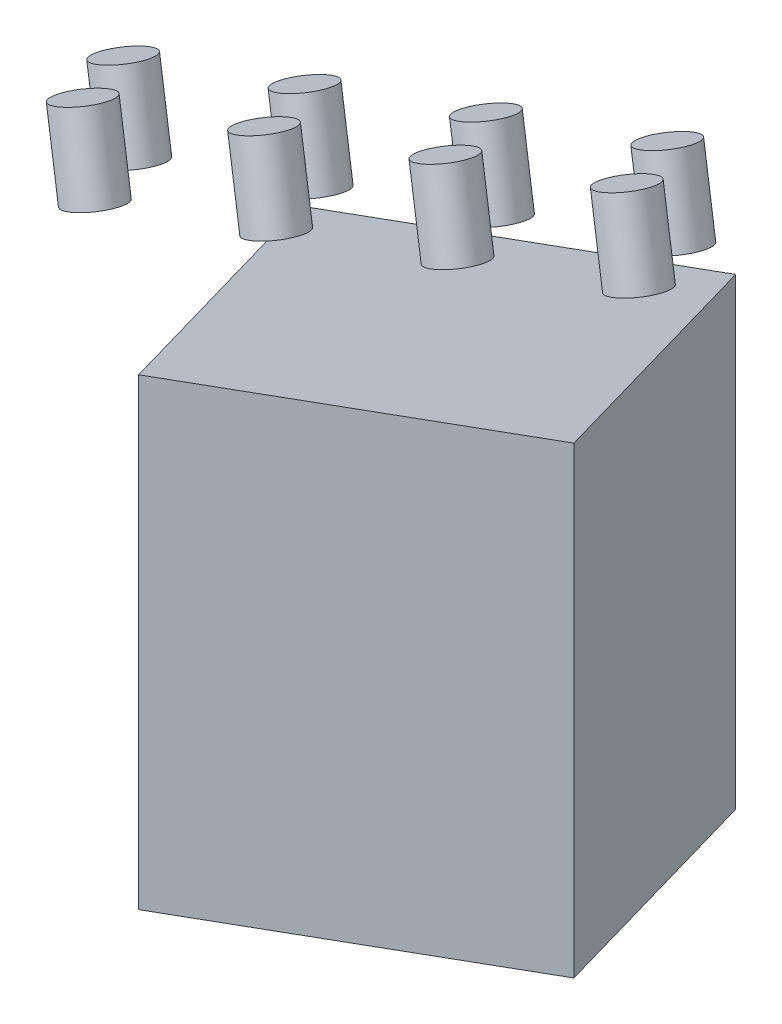
ISO-10303-21;
HEADER;
FILE_DESCRIPTION(('STEP AP214'),'2;1');
FILE_NAME('part.step','',(''),(''),'','','');
FILE_SCHEMA(('AUTOMOTIVE_DESIGN { 1 0 10303 214 1 1 1 1 }'));
ENDSEC;
DATA;
#1=APPLICATION_CONTEXT('core data for automotive mechanical design processes');
#2=APPLICATION_PROTOCOL_DEFINITION('international standard','automotive_design',2000,#1);
#3=PRODUCT_CONTEXT('',#1,'mechanical');
#4=PRODUCT('Part','Part','',(#3));
#5=PRODUCT_RELATED_PRODUCT_CATEGORY('part','',(#4));
#6=PRODUCT_DEFINITION_FORMATION('','',#4);
#7=PRODUCT_DEFINITION_CONTEXT('part definition',#1,'design');
#8=PRODUCT_DEFINITION('design','',#6,#7);
#9=PRODUCT_DEFINITION_SHAPE('','',#8);
#10=(LENGTH_UNIT() NAMED_UNIT(*) SI_UNIT(.MILLI.,.METRE.));
#11=(NAMED_UNIT(*) PLANE_ANGLE_UNIT() SI_UNIT($,.RADIAN.));
#12=(NAMED_UNIT(*) SI_UNIT($,.STERADIAN.) SOLID_ANGLE_UNIT());
#13=UNCERTAINTY_MEASURE_WITH_UNIT(LENGTH_MEASURE(1.E-05),#10,'distance_accuracy_value','');
#14=(GEOMETRIC_REPRESENTATION_CONTEXT(3) GLOBAL_UNCERTAINTY_ASSIGNED_CONTEXT((#13)) GLOBAL_UNIT_ASSIGNED_CONTEXT((#10,
#11,#12)) REPRESENTATION_CONTEXT('',''));
#15=CARTESIAN_POINT('',(0.,0.,0.));
#16=DIRECTION('',(0.,0.,1.));
#17=DIRECTION('',(1.,0.,0.));
#18=AXIS2_PLACEMENT_3D('',#15,#16,#17);
#19=CARTESIAN_POINT('',(-29.5986839364483,58.7634470395438,-6.62993275582684));
#20=DIRECTION('',(0.3365382859498,-0.924631341429047,0.178322361292947));
#21=DIRECTION('',(0.939692620785909,0.342020143325666,0.));
#22=AXIS2_PLACEMENT_3D('',#19,#20,#21);
#23=CYLINDRICAL_SURFACE('',#22,3.35836070254508);
#24=CARTESIAN_POINT('',(-29.5986839364483,58.7634470395438,-6.62993275582684));
#25=DIRECTION('',(-0.3365382859498,0.924631341429047,-0.178322361292947));
#26=DIRECTION('',(-0.939692620785909,-0.342020143325666,0.));
#27=AXIS2_PLACEMENT_3D('',#24,#25,#26);
#28=CIRCLE('',#27,3.35836070254508);
#29=CARTESIAN_POINT('',(-32.7545107065673,57.6148200307201,-6.62993275582684));
#30=VERTEX_POINT('',#29);
#31=EDGE_CURVE('E11',#30,#30,#28,.T.);
#32=ORIENTED_EDGE('',*,*,#31,.F.);
#33=EDGE_LOOP('',(#32));
#34=FACE_BOUND('',#33,.T.);
#35=CARTESIAN_POINT('',(-26.2333010769503,49.5171336252533,-4.84670914289737));
#36=DIRECTION('',(-0.3365382859498,0.924631341429047,-0.178322361292947));
#37=DIRECTION('',(-0.939692620785909,-0.342020143325666,0.));
#38=AXIS2_PLACEMENT_3D('',#35,#36,#37);
#39=CIRCLE('',#38,3.35836070254508);
#40=CARTESIAN_POINT('',(-29.3891278470693,48.3685066164296,-4.84670914289737));
#41=VERTEX_POINT('',#40);
#42=EDGE_CURVE('E45',#41,#41,#39,.T.);
#43=ORIENTED_EDGE('',*,*,#42,.T.);
#44=EDGE_LOOP('',(#43));
#45=FACE_BOUND('',#44,.T.);
#46=ADVANCED_FACE('F42',(#34,#45),#23,.T.);
#47=CARTESIAN_POINT('',(-29.5986839364483,58.7634470395438,-6.62993275582684));
#48=DIRECTION('',(-0.3365382859498,0.924631341429047,-0.178322361292947));
#49=DIRECTION('',(-0.939692620785909,-0.342020143325666,0.));
#50=AXIS2_PLACEMENT_3D('',#47,#48,#49);
#51=PLANE('',#50);
#52=ORIENTED_EDGE('',*,*,#31,.T.);
#53=EDGE_LOOP('',(#52));
#54=FACE_BOUND('',#53,.T.);
#55=ADVANCED_FACE('F57',(#54),#51,.T.);
#56=CARTESIAN_POINT('',(-26.2333010769503,49.5171336252533,-4.84670914289737));
#57=DIRECTION('',(-0.3365382859498,0.924631341429047,-0.178322361292947));
#58=DIRECTION('',(-0.939692620785909,-0.342020143325666,0.));
#59=AXIS2_PLACEMENT_3D('',#56,#57,#58);
#60=PLANE('',#59);
#61=ORIENTED_EDGE('',*,*,#42,.F.);
#62=EDGE_LOOP('',(#61));
#63=FACE_BOUND('',#62,.T.);
#64=ADVANCED_FACE('F55',(#63),#60,.F.);
#65=CLOSED_SHELL('',(#46,#55,#64));
#66=MANIFOLD_SOLID_BREP('B2',#65);
#67=CARTESIAN_POINT('',(-22.550989280554,63.6982959646013,5.65734790850802));
#68=DIRECTION('',(0.3365382859498,-0.924631341429047,0.178322361292947));
#69=DIRECTION('',(0.939692620785909,0.342020143325666,0.));
#70=AXIS2_PLACEMENT_3D('',#67,#68,#69);
#71=CYLINDRICAL_SURFACE('',#70,3.35836070254508);
#72=CARTESIAN_POINT('',(-22.550989280554,63.6982959646013,5.65734790850802));
#73=DIRECTION('',(-0.3365382859498,0.924631341429047,-0.178322361292947));
#74=DIRECTION('',(-0.939692620785909,-0.342020143325666,0.));
#75=AXIS2_PLACEMENT_3D('',#72,#73,#74);
#76=CIRCLE('',#75,3.35836070254508);
#77=CARTESIAN_POINT('',(-25.706816050673,62.5496689557776,5.65734790850802));
#78=VERTEX_POINT('',#77);
#79=EDGE_CURVE('E41',#78,#78,#76,.T.);
#80=ORIENTED_EDGE('',*,*,#79,.F.);
#81=EDGE_LOOP('',(#80));
#82=FACE_BOUND('',#81,.T.);
#83=CARTESIAN_POINT('',(-19.185606421056,54.4519825503108,7.4405715214375));
#84=DIRECTION('',(-0.3365382859498,0.924631341429047,-0.178322361292947));
#85=DIRECTION('',(-0.939692620785909,-0.342020143325666,0.));
#86=AXIS2_PLACEMENT_3D('',#83,#84,#85);
#87=CIRCLE('',#86,3.35836070254508);
#88=CARTESIAN_POINT('',(-22.3414331911749,53.3033555414871,7.4405715214375));
#89=VERTEX_POINT('',#88);
#90=EDGE_CURVE('E94',#89,#89,#87,.T.);
#91=ORIENTED_EDGE('',*,*,#90,.T.);
#92=EDGE_LOOP('',(#91));
#93=FACE_BOUND('',#92,.T.);
#94=ADVANCED_FACE('F91',(#82,#93),#71,.T.);
#95=CARTESIAN_POINT('',(-22.550989280554,63.6982959646013,5.65734790850802));
#96=DIRECTION('',(-0.3365382859498,0.924631341429047,-0.178322361292947));
#97=DIRECTION('',(-0.939692620785909,-0.342020143325666,0.));
#98=AXIS2_PLACEMENT_3D('',#95,#96,#97);
#99=PLANE('',#98);
#100=ORIENTED_EDGE('',*,*,#79,.T.);
#101=EDGE_LOOP('',(#100));
#102=FACE_BOUND('',#101,.T.);
#103=ADVANCED_FACE('F106',(#102),#99,.T.);
#104=CARTESIAN_POINT('',(-19.185606421056,54.4519825503108,7.4405715214375));
#105=DIRECTION('',(-0.3365382859498,0.924631341429047,-0.178322361292947));
#106=DIRECTION('',(-0.939692620785909,-0.342020143325666,0.));
#107=AXIS2_PLACEMENT_3D('',#104,#105,#106);
#108=PLANE('',#107);
#109=ORIENTED_EDGE('',*,*,#90,.F.);
#110=EDGE_LOOP('',(#109));
#111=FACE_BOUND('',#110,.T.);
#112=ADVANCED_FACE('F104',(#111),#108,.F.);
#113=CLOSED_SHELL('',(#94,#103,#112));
#114=MANIFOLD_SOLID_BREP('B6',#113);
#115=CARTESIAN_POINT('',(-6.10636841680053,67.3139506226855,-6.62993275582684));
#116=DIRECTION('',(0.3365382859498,-0.924631341429047,0.178322361292947));
#117=DIRECTION('',(0.939692620785909,0.342020143325666,0.));
#118=AXIS2_PLACEMENT_3D('',#115,#116,#117);
#119=CYLINDRICAL_SURFACE('',#118,3.35836070254508);
#120=CARTESIAN_POINT('',(-6.10636841680053,67.3139506226855,-6.62993275582684));
#121=DIRECTION('',(-0.3365382859498,0.924631341429047,-0.178322361292947));
#122=DIRECTION('',(-0.939692620785909,-0.342020143325666,0.));
#123=AXIS2_PLACEMENT_3D('',#120,#121,#122);
#124=CIRCLE('',#123,3.35836070254508);
#125=CARTESIAN_POINT('',(-9.26219518691953,66.1653236138617,-6.62993275582684));
#126=VERTEX_POINT('',#125);
#127=EDGE_CURVE('E90',#126,#126,#124,.T.);
#128=ORIENTED_EDGE('',*,*,#127,.F.);
#129=EDGE_LOOP('',(#128));
#130=FACE_BOUND('',#129,.T.);
#131=CARTESIAN_POINT('',(-2.74098555730253,58.067637208395,-4.84670914289737));
#132=DIRECTION('',(-0.3365382859498,0.924631341429047,-0.178322361292947));
#133=DIRECTION('',(-0.939692620785909,-0.342020143325666,0.));
#134=AXIS2_PLACEMENT_3D('',#131,#132,#133);
#135=CIRCLE('',#134,3.35836070254508);
#136=CARTESIAN_POINT('',(-5.89681232742153,56.9190101995712,-4.84670914289737));
#137=VERTEX_POINT('',#136);
#138=EDGE_CURVE('E143',#137,#137,#135,.T.);
#139=ORIENTED_EDGE('',*,*,#138,.T.);
#140=EDGE_LOOP('',(#139));
#141=FACE_BOUND('',#140,.T.);
#142=ADVANCED_FACE('F140',(#130,#141),#119,.T.);
#143=CARTESIAN_POINT('',(-6.10636841680053,67.3139506226855,-6.62993275582684));
#144=DIRECTION('',(-0.3365382859498,0.924631341429047,-0.178322361292947));
#145=DIRECTION('',(-0.939692620785909,-0.342020143325666,0.));
#146=AXIS2_PLACEMENT_3D('',#143,#144,#145);
#147=PLANE('',#146);
#148=ORIENTED_EDGE('',*,*,#127,.T.);
#149=EDGE_LOOP('',(#148));
#150=FACE_BOUND('',#149,.T.);
#151=ADVANCED_FACE('F155',(#150),#147,.T.);
#152=CARTESIAN_POINT('',(-2.74098555730253,58.067637208395,-4.84670914289737));
#153=DIRECTION('',(-0.3365382859498,0.924631341429047,-0.178322361292947));
#154=DIRECTION('',(-0.939692620785909,-0.342020143325666,0.));
#155=AXIS2_PLACEMENT_3D('',#152,#153,#154);
#156=PLANE('',#155);
#157=ORIENTED_EDGE('',*,*,#138,.F.);
#158=EDGE_LOOP('',(#157));
#159=FACE_BOUND('',#158,.T.);
#160=ADVANCED_FACE('F153',(#159),#156,.F.);
#161=CLOSED_SHELL('',(#142,#151,#160));
#162=MANIFOLD_SOLID_BREP('B36',#161);
#163=CARTESIAN_POINT('',(0.941326239093785,72.248799547743,5.65734790850802));
#164=DIRECTION('',(0.3365382859498,-0.924631341429047,0.178322361292947));
#165=DIRECTION('',(0.939692620785909,0.342020143325666,0.));
#166=AXIS2_PLACEMENT_3D('',#163,#164,#165);
#167=CYLINDRICAL_SURFACE('',#166,3.35836070254508);
#168=CARTESIAN_POINT('',(0.941326239093785,72.248799547743,5.65734790850802));
#169=DIRECTION('',(-0.3365382859498,0.924631341429047,-0.178322361292947));
#170=DIRECTION('',(-0.939692620785909,-0.342020143325666,0.));
#171=AXIS2_PLACEMENT_3D('',#168,#169,#170);
#172=CIRCLE('',#171,3.35836070254508);
#173=CARTESIAN_POINT('',(-2.21450053102521,71.1001725389192,5.65734790850802));
#174=VERTEX_POINT('',#173);
#175=EDGE_CURVE('E139',#174,#174,#172,.T.);
#176=ORIENTED_EDGE('',*,*,#175,.F.);
#177=EDGE_LOOP('',(#176));
#178=FACE_BOUND('',#177,.T.);
#179=CARTESIAN_POINT('',(4.30670909859179,63.0024861334525,7.4405715214375));
#180=DIRECTION('',(-0.3365382859498,0.924631341429047,-0.178322361292947));
#181=DIRECTION('',(-0.939692620785909,-0.342020143325666,0.));
#182=AXIS2_PLACEMENT_3D('',#179,#180,#181);
#183=CIRCLE('',#182,3.35836070254508);
#184=CARTESIAN_POINT('',(1.15088232847279,61.8538591246288,7.4405715214375));
#185=VERTEX_POINT('',#184);
#186=EDGE_CURVE('E192',#185,#185,#183,.T.);
#187=ORIENTED_EDGE('',*,*,#186,.T.);
#188=EDGE_LOOP('',(#187));
#189=FACE_BOUND('',#188,.T.);
#190=ADVANCED_FACE('F189',(#178,#189),#167,.T.);
#191=CARTESIAN_POINT('',(0.941326239093785,72.248799547743,5.65734790850802));
#192=DIRECTION('',(-0.3365382859498,0.924631341429047,-0.178322361292947));
#193=DIRECTION('',(-0.939692620785909,-0.342020143325666,0.));
#194=AXIS2_PLACEMENT_3D('',#191,#192,#193);
#195=PLANE('',#194);
#196=ORIENTED_EDGE('',*,*,#175,.T.);
#197=EDGE_LOOP('',(#196));
#198=FACE_BOUND('',#197,.T.);
#199=ADVANCED_FACE('F204',(#198),#195,.T.);
#200=CARTESIAN_POINT('',(4.30670909859179,63.0024861334525,7.4405715214375));
#201=DIRECTION('',(-0.3365382859498,0.924631341429047,-0.178322361292947));
#202=DIRECTION('',(-0.939692620785909,-0.342020143325666,0.));
#203=AXIS2_PLACEMENT_3D('',#200,#201,#202);
#204=PLANE('',#203);
#205=ORIENTED_EDGE('',*,*,#186,.F.);
#206=EDGE_LOOP('',(#205));
#207=FACE_BOUND('',#206,.T.);
#208=ADVANCED_FACE('F202',(#207),#204,.F.);
#209=CLOSED_SHELL('',(#190,#199,#208));
#210=MANIFOLD_SOLID_BREP('B85',#209);
#211=CARTESIAN_POINT('',(17.3859471028472,75.8644542058271,-6.62993275582684));
#212=DIRECTION('',(0.3365382859498,-0.924631341429047,0.178322361292947));
#213=DIRECTION('',(0.939692620785909,0.342020143325666,0.));
#214=AXIS2_PLACEMENT_3D('',#211,#212,#213);
#215=CYLINDRICAL_SURFACE('',#214,3.35836070254508);
#216=CARTESIAN_POINT('',(17.3859471028472,75.8644542058271,-6.62993275582684));
#217=DIRECTION('',(-0.3365382859498,0.924631341429047,-0.178322361292947));
#218=DIRECTION('',(-0.939692620785909,-0.342020143325666,0.));
#219=AXIS2_PLACEMENT_3D('',#216,#217,#218);
#220=CIRCLE('',#219,3.35836070254508);
#221=CARTESIAN_POINT('',(14.2301203327282,74.7158271970034,-6.62993275582684));
#222=VERTEX_POINT('',#221);
#223=EDGE_CURVE('E188',#222,#222,#220,.T.);
#224=ORIENTED_EDGE('',*,*,#223,.F.);
#225=EDGE_LOOP('',(#224));
#226=FACE_BOUND('',#225,.T.);
#227=CARTESIAN_POINT('',(20.7513299623452,66.6181407915367,-4.84670914289737));
#228=DIRECTION('',(-0.3365382859498,0.924631341429047,-0.178322361292947));
#229=DIRECTION('',(-0.939692620785909,-0.342020143325666,0.));
#230=AXIS2_PLACEMENT_3D('',#227,#228,#229);
#231=CIRCLE('',#230,3.35836070254508);
#232=CARTESIAN_POINT('',(17.5955031922262,65.4695137827129,-4.84670914289737));
#233=VERTEX_POINT('',#232);
#234=EDGE_CURVE('E241',#233,#233,#231,.T.);
#235=ORIENTED_EDGE('',*,*,#234,.T.);
#236=EDGE_LOOP('',(#235));
#237=FACE_BOUND('',#236,.T.);
#238=ADVANCED_FACE('F238',(#226,#237),#215,.T.);
#239=CARTESIAN_POINT('',(17.3859471028472,75.8644542058271,-6.62993275582684));
#240=DIRECTION('',(-0.3365382859498,0.924631341429047,-0.178322361292947));
#241=DIRECTION('',(-0.939692620785909,-0.342020143325666,0.));
#242=AXIS2_PLACEMENT_3D('',#239,#240,#241);
#243=PLANE('',#242);
#244=ORIENTED_EDGE('',*,*,#223,.T.);
#245=EDGE_LOOP('',(#244));
#246=FACE_BOUND('',#245,.T.);
#247=ADVANCED_FACE('F253',(#246),#243,.T.);
#248=CARTESIAN_POINT('',(20.7513299623452,66.6181407915367,-4.84670914289737));
#249=DIRECTION('',(-0.3365382859498,0.924631341429047,-0.178322361292947));
#250=DIRECTION('',(-0.939692620785909,-0.342020143325666,0.));
#251=AXIS2_PLACEMENT_3D('',#248,#249,#250);
#252=PLANE('',#251);
#253=ORIENTED_EDGE('',*,*,#234,.F.);
#254=EDGE_LOOP('',(#253));
#255=FACE_BOUND('',#254,.T.);
#256=ADVANCED_FACE('F251',(#255),#252,.F.);
#257=CLOSED_SHELL('',(#238,#247,#256));
#258=MANIFOLD_SOLID_BREP('B134',#257);
#259=CARTESIAN_POINT('',(24.4336417587415,80.7993031308846,5.65734790850802));
#260=DIRECTION('',(0.3365382859498,-0.924631341429047,0.178322361292947));
#261=DIRECTION('',(0.939692620785909,0.342020143325666,0.));
#262=AXIS2_PLACEMENT_3D('',#259,#260,#261);
#263=CYLINDRICAL_SURFACE('',#262,3.35836070254508);
#264=CARTESIAN_POINT('',(24.4336417587415,80.7993031308846,5.65734790850802));
#265=DIRECTION('',(-0.3365382859498,0.924631341429047,-0.178322361292947));
#266=DIRECTION('',(-0.939692620785909,-0.342020143325666,0.));
#267=AXIS2_PLACEMENT_3D('',#264,#265,#266);
#268=CIRCLE('',#267,3.35836070254508);
#269=CARTESIAN_POINT('',(21.2778149886225,79.6506761220609,5.65734790850802));
#270=VERTEX_POINT('',#269);
#271=EDGE_CURVE('E237',#270,#270,#268,.T.);
#272=ORIENTED_EDGE('',*,*,#271,.F.);
#273=EDGE_LOOP('',(#272));
#274=FACE_BOUND('',#273,.T.);
#275=CARTESIAN_POINT('',(27.7990246182395,71.5529897165942,7.4405715214375));
#276=DIRECTION('',(-0.3365382859498,0.924631341429047,-0.178322361292947));
#277=DIRECTION('',(-0.939692620785909,-0.342020143325666,0.));
#278=AXIS2_PLACEMENT_3D('',#275,#276,#277);
#279=CIRCLE('',#278,3.35836070254508);
#280=CARTESIAN_POINT('',(24.6431978481205,70.4043627077704,7.4405715214375));
#281=VERTEX_POINT('',#280);
#282=EDGE_CURVE('E290',#281,#281,#279,.T.);
#283=ORIENTED_EDGE('',*,*,#282,.T.);
#284=EDGE_LOOP('',(#283));
#285=FACE_BOUND('',#284,.T.);
#286=ADVANCED_FACE('F287',(#274,#285),#263,.T.);
#287=CARTESIAN_POINT('',(24.4336417587415,80.7993031308846,5.65734790850802));
#288=DIRECTION('',(-0.3365382859498,0.924631341429047,-0.178322361292947));
#289=DIRECTION('',(-0.939692620785909,-0.342020143325666,0.));
#290=AXIS2_PLACEMENT_3D('',#287,#288,#289);
#291=PLANE('',#290);
#292=ORIENTED_EDGE('',*,*,#271,.T.);
#293=EDGE_LOOP('',(#292));
#294=FACE_BOUND('',#293,.T.);
#295=ADVANCED_FACE('F302',(#294),#291,.T.);
#296=CARTESIAN_POINT('',(27.7990246182395,71.5529897165942,7.4405715214375));
#297=DIRECTION('',(-0.3365382859498,0.924631341429047,-0.178322361292947));
#298=DIRECTION('',(-0.939692620785909,-0.342020143325666,0.));
#299=AXIS2_PLACEMENT_3D('',#296,#297,#298);
#300=PLANE('',#299);
#301=ORIENTED_EDGE('',*,*,#282,.F.);
#302=EDGE_LOOP('',(#301));
#303=FACE_BOUND('',#302,.T.);
#304=ADVANCED_FACE('F300',(#303),#300,.F.);
#305=CLOSED_SHELL('',(#286,#295,#304));
#306=MANIFOLD_SOLID_BREP('B183',#305);
#307=CARTESIAN_POINT('',(40.8782626224949,84.4149577889688,-6.62993275582684));
#308=DIRECTION('',(0.3365382859498,-0.924631341429047,0.178322361292947));
#309=DIRECTION('',(0.939692620785909,0.342020143325666,0.));
#310=AXIS2_PLACEMENT_3D('',#307,#308,#309);
#311=CYLINDRICAL_SURFACE('',#310,3.35836070254508);
#312=CARTESIAN_POINT('',(40.8782626224949,84.4149577889688,-6.62993275582684));
#313=DIRECTION('',(-0.3365382859498,0.924631341429047,-0.178322361292947));
#314=DIRECTION('',(-0.939692620785909,-0.342020143325666,0.));
#315=AXIS2_PLACEMENT_3D('',#312,#313,#314);
#316=CIRCLE('',#315,3.35836070254508);
#317=CARTESIAN_POINT('',(37.7224358523759,83.266330780145,-6.62993275582684));
#318=VERTEX_POINT('',#317);
#319=EDGE_CURVE('E286',#318,#318,#316,.T.);
#320=ORIENTED_EDGE('',*,*,#319,.F.);
#321=EDGE_LOOP('',(#320));
#322=FACE_BOUND('',#321,.T.);
#323=CARTESIAN_POINT('',(44.2436454819929,75.1686443746783,-4.84670914289737));
#324=DIRECTION('',(-0.3365382859498,0.924631341429047,-0.178322361292947));
#325=DIRECTION('',(-0.939692620785909,-0.342020143325666,0.));
#326=AXIS2_PLACEMENT_3D('',#323,#324,#325);
#327=CIRCLE('',#326,3.35836070254508);
#328=CARTESIAN_POINT('',(41.087818711874,74.0200173658545,-4.84670914289737));
#329=VERTEX_POINT('',#328);
#330=EDGE_CURVE('E339',#329,#329,#327,.T.);
#331=ORIENTED_EDGE('',*,*,#330,.T.);
#332=EDGE_LOOP('',(#331));
#333=FACE_BOUND('',#332,.T.);
#334=ADVANCED_FACE('F336',(#322,#333),#311,.T.);
#335=CARTESIAN_POINT('',(40.8782626224949,84.4149577889688,-6.62993275582684));
#336=DIRECTION('',(-0.3365382859498,0.924631341429047,-0.178322361292947));
#337=DIRECTION('',(-0.939692620785909,-0.342020143325666,0.));
#338=AXIS2_PLACEMENT_3D('',#335,#336,#337);
#339=PLANE('',#338);
#340=ORIENTED_EDGE('',*,*,#319,.T.);
#341=EDGE_LOOP('',(#340));
#342=FACE_BOUND('',#341,.T.);
#343=ADVANCED_FACE('F351',(#342),#339,.T.);
#344=CARTESIAN_POINT('',(44.2436454819929,75.1686443746783,-4.84670914289737));
#345=DIRECTION('',(-0.3365382859498,0.924631341429047,-0.178322361292947));
#346=DIRECTION('',(-0.939692620785909,-0.342020143325666,0.));
#347=AXIS2_PLACEMENT_3D('',#344,#345,#346);
#348=PLANE('',#347);
#349=ORIENTED_EDGE('',*,*,#330,.F.);
#350=EDGE_LOOP('',(#349));
#351=FACE_BOUND('',#350,.T.);
#352=ADVANCED_FACE('F349',(#351),#348,.F.);
#353=CLOSED_SHELL('',(#334,#343,#352));
#354=MANIFOLD_SOLID_BREP('B232',#353);
#355=CARTESIAN_POINT('',(47.9259572783893,89.3498067140263,5.65734790850802));
#356=DIRECTION('',(0.3365382859498,-0.924631341429047,0.178322361292947));
#357=DIRECTION('',(0.939692620785909,0.342020143325666,0.));
#358=AXIS2_PLACEMENT_3D('',#355,#356,#357);
#359=CYLINDRICAL_SURFACE('',#358,3.35836070254508);
#360=CARTESIAN_POINT('',(47.9259572783893,89.3498067140263,5.65734790850802));
#361=DIRECTION('',(-0.3365382859498,0.924631341429047,-0.178322361292947));
#362=DIRECTION('',(-0.939692620785909,-0.342020143325666,0.));
#363=AXIS2_PLACEMENT_3D('',#360,#361,#362);
#364=CIRCLE('',#363,3.35836070254508);
#365=CARTESIAN_POINT('',(44.7701305082703,88.2011797052025,5.65734790850802));
#366=VERTEX_POINT('',#365);
#367=EDGE_CURVE('E335',#366,#366,#364,.T.);
#368=ORIENTED_EDGE('',*,*,#367,.F.);
#369=EDGE_LOOP('',(#368));
#370=FACE_BOUND('',#369,.T.);
#371=CARTESIAN_POINT('',(51.2913401378873,80.1034932997358,7.4405715214375));
#372=DIRECTION('',(-0.3365382859498,0.924631341429047,-0.178322361292947));
#373=DIRECTION('',(-0.939692620785909,-0.342020143325666,0.));
#374=AXIS2_PLACEMENT_3D('',#371,#372,#373);
#375=CIRCLE('',#374,3.35836070254508);
#376=CARTESIAN_POINT('',(48.1355133677683,78.9548662909121,7.4405715214375));
#377=VERTEX_POINT('',#376);
#378=EDGE_CURVE('E389',#377,#377,#375,.T.);
#379=ORIENTED_EDGE('',*,*,#378,.T.);
#380=EDGE_LOOP('',(#379));
#381=FACE_BOUND('',#380,.T.);
#382=ADVANCED_FACE('F386',(#370,#381),#359,.T.);
#383=CARTESIAN_POINT('',(47.9259572783893,89.3498067140263,5.65734790850802));
#384=DIRECTION('',(-0.3365382859498,0.924631341429047,-0.178322361292947));
#385=DIRECTION('',(-0.939692620785909,-0.342020143325666,0.));
#386=AXIS2_PLACEMENT_3D('',#383,#384,#385);
#387=PLANE('',#386);
#388=ORIENTED_EDGE('',*,*,#367,.T.);
#389=EDGE_LOOP('',(#388));
#390=FACE_BOUND('',#389,.T.);
#391=ADVANCED_FACE('F401',(#390),#387,.T.);
#392=CARTESIAN_POINT('',(51.2913401378873,80.1034932997358,7.4405715214375));
#393=DIRECTION('',(-0.3365382859498,0.924631341429047,-0.178322361292947));
#394=DIRECTION('',(-0.939692620785909,-0.342020143325666,0.));
#395=AXIS2_PLACEMENT_3D('',#392,#393,#394);
#396=PLANE('',#395);
#397=ORIENTED_EDGE('',*,*,#378,.F.);
#398=EDGE_LOOP('',(#397));
#399=FACE_BOUND('',#398,.T.);
#400=ADVANCED_FACE('F399',(#399),#396,.F.);
#401=CLOSED_SHELL('',(#382,#391,#400));
#402=MANIFOLD_SOLID_BREP('B281',#401);
#403=CARTESIAN_POINT('',(0.,0.,0.));
#404=DIRECTION('',(0.,0.,1.));
#405=DIRECTION('',(1.,0.,0.));
#406=AXIS2_PLACEMENT_3D('',#403,#404,#405);
#407=PLANE('',#406);
#408=DIRECTION('',(0.939692620785909,0.342020143325666,0.));
#409=VECTOR('',#408,1.);
#410=CARTESIAN_POINT('',(0.,0.,0.));
#411=LINE('',#410,#409);
#412=CARTESIAN_POINT('',(0.,0.,0.));
#413=VERTEX_POINT('',#412);
#414=CARTESIAN_POINT('',(56.3815572471545,20.52120859954,0.));
#415=VERTEX_POINT('',#414);
#416=EDGE_CURVE('E469',#413,#415,#411,.T.);
#417=ORIENTED_EDGE('',*,*,#416,.F.);
#418=DIRECTION('',(0.,-1.,0.));
#419=VECTOR('',#418,1.);
#420=CARTESIAN_POINT('',(0.,0.,0.));
#421=LINE('',#420,#419);
#422=CARTESIAN_POINT('',(0.,60.,0.));
#423=VERTEX_POINT('',#422);
#424=EDGE_CURVE('E457',#423,#413,#421,.T.);
#425=ORIENTED_EDGE('',*,*,#424,.F.);
#426=DIRECTION('',(-0.939692620785909,-0.342020143325666,0.));
#427=VECTOR('',#426,1.);
#428=CARTESIAN_POINT('',(0.,60.,0.));
#429=LINE('',#428,#427);
#430=CARTESIAN_POINT('',(56.3815572471546,80.52120859954,0.));
#431=VERTEX_POINT('',#430);
#432=EDGE_CURVE('E462',#431,#423,#429,.T.);
#433=ORIENTED_EDGE('',*,*,#432,.F.);
#434=DIRECTION('',(0.,1.,0.));
#435=VECTOR('',#434,1.);
#436=CARTESIAN_POINT('',(56.3815572471545,20.52120859954,0.));
#437=LINE('',#436,#435);
#438=EDGE_CURVE('E466',#415,#431,#437,.T.);
#439=ORIENTED_EDGE('',*,*,#438,.F.);
#440=EDGE_LOOP('',(#417,#425,#433,#439));
#441=FACE_BOUND('',#440,.T.);
#442=ADVANCED_FACE('F427',(#441),#407,.F.);
#443=CARTESIAN_POINT('',(28.1907786235773,19.73939570023,49.1491226573394));
#444=DIRECTION('',(0.,0.,1.));
#445=DIRECTION('',(1.,0.,0.));
#446=AXIS2_PLACEMENT_3D('',#443,#444,#445);
#447=PLANE('',#446);
#448=DIRECTION('',(0.939692620785909,0.342020143325666,0.));
#449=VECTOR('',#448,1.);
#450=CARTESIAN_POINT('',(28.1907786235773,19.73939570023,49.1491226573394));
#451=LINE('',#450,#449);
#452=CARTESIAN_POINT('',(28.1907786235773,19.73939570023,49.1491226573394));
#453=VERTEX_POINT('',#452);
#454=CARTESIAN_POINT('',(84.5723358707318,40.26060429977,49.1491226573394));
#455=VERTEX_POINT('',#454);
#456=EDGE_CURVE('E483',#453,#455,#451,.T.);
#457=ORIENTED_EDGE('',*,*,#456,.T.);
#458=DIRECTION('',(0.,1.,0.));
#459=VECTOR('',#458,1.);
#460=CARTESIAN_POINT('',(84.5723358707318,40.26060429977,49.1491226573394));
#461=LINE('',#460,#459);
#462=CARTESIAN_POINT('',(84.5723358707318,100.26060429977,49.1491226573394));
#463=VERTEX_POINT('',#462);
#464=EDGE_CURVE('E446',#455,#463,#461,.T.);
#465=ORIENTED_EDGE('',*,*,#464,.T.);
#466=DIRECTION('',(-0.939692620785909,-0.342020143325666,0.));
#467=VECTOR('',#466,1.);
#468=CARTESIAN_POINT('',(28.1907786235773,79.73939570023,49.1491226573394));
#469=LINE('',#468,#467);
#470=CARTESIAN_POINT('',(28.1907786235773,79.73939570023,49.1491226573394));
#471=VERTEX_POINT('',#470);
#472=EDGE_CURVE('E440',#463,#471,#469,.T.);
#473=ORIENTED_EDGE('',*,*,#472,.T.);
#474=DIRECTION('',(0.,-1.,0.));
#475=VECTOR('',#474,1.);
#476=CARTESIAN_POINT('',(28.1907786235773,19.73939570023,49.1491226573394));
#477=LINE('',#476,#475);
#478=EDGE_CURVE('E384',#471,#453,#477,.T.);
#479=ORIENTED_EDGE('',*,*,#478,.T.);
#480=EDGE_LOOP('',(#457,#465,#473,#479));
#481=FACE_BOUND('',#480,.T.);
#482=ADVANCED_FACE('F508',(#481),#447,.T.);
#483=CARTESIAN_POINT('',(0.,0.,0.));
#484=DIRECTION('',(0.3365382859498,-0.924631341429047,0.178322361292947));
#485=DIRECTION('',(0.939692620785909,0.342020143325666,0.));
#486=AXIS2_PLACEMENT_3D('',#483,#484,#485);
#487=PLANE('',#486);
#488=DIRECTION('',(0.469846310392955,0.328989928337167,0.819152044288991));
#489=VECTOR('',#488,1.);
#490=CARTESIAN_POINT('',(56.3815572471545,20.52120859954,0.));
#491=LINE('',#490,#489);
#492=EDGE_CURVE('E485',#415,#455,#491,.T.);
#493=ORIENTED_EDGE('',*,*,#492,.T.);
#494=ORIENTED_EDGE('',*,*,#456,.F.);
#495=DIRECTION('',(0.469846310392955,0.328989928337167,0.819152044288991));
#496=VECTOR('',#495,1.);
#497=CARTESIAN_POINT('',(0.,0.,0.));
#498=LINE('',#497,#496);
#499=EDGE_CURVE('E479',#413,#453,#498,.T.);
#500=ORIENTED_EDGE('',*,*,#499,.F.);
#501=ORIENTED_EDGE('',*,*,#416,.T.);
#502=EDGE_LOOP('',(#493,#494,#500,#501));
#503=FACE_BOUND('',#502,.T.);
#504=ADVANCED_FACE('F482',(#503),#487,.T.);
#505=CARTESIAN_POINT('',(56.3815572471545,20.52120859954,0.));
#506=DIRECTION('',(0.867439421552547,0.,-0.497542812164524));
#507=DIRECTION('',(-0.497542812164524,0.,-0.867439421552547));
#508=AXIS2_PLACEMENT_3D('',#505,#506,#507);
#509=PLANE('',#508);
#510=DIRECTION('',(0.469846310392955,0.328989928337167,0.819152044288991));
#511=VECTOR('',#510,1.);
#512=CARTESIAN_POINT('',(56.3815572471546,80.52120859954,0.));
#513=LINE('',#512,#511);
#514=EDGE_CURVE('E491',#431,#463,#513,.T.);
#515=ORIENTED_EDGE('',*,*,#514,.T.);
#516=ORIENTED_EDGE('',*,*,#464,.F.);
#517=ORIENTED_EDGE('',*,*,#492,.F.);
#518=ORIENTED_EDGE('',*,*,#438,.T.);
#519=EDGE_LOOP('',(#515,#516,#517,#518));
#520=FACE_BOUND('',#519,.T.);
#521=ADVANCED_FACE('F500',(#520),#509,.T.);
#522=CARTESIAN_POINT('',(0.,60.,0.));
#523=DIRECTION('',(-0.3365382859498,0.924631341429047,-0.178322361292947));
#524=DIRECTION('',(-0.939692620785909,-0.342020143325666,0.));
#525=AXIS2_PLACEMENT_3D('',#522,#523,#524);
#526=PLANE('',#525);
#527=DIRECTION('',(0.469846310392955,0.328989928337167,0.819152044288991));
#528=VECTOR('',#527,1.);
#529=CARTESIAN_POINT('',(0.,60.,0.));
#530=LINE('',#529,#528);
#531=EDGE_CURVE('E434',#423,#471,#530,.T.);
#532=ORIENTED_EDGE('',*,*,#531,.T.);
#533=ORIENTED_EDGE('',*,*,#472,.F.);
#534=ORIENTED_EDGE('',*,*,#514,.F.);
#535=ORIENTED_EDGE('',*,*,#432,.T.);
#536=EDGE_LOOP('',(#532,#533,#534,#535));
#537=FACE_BOUND('',#536,.T.);
#538=ADVANCED_FACE('F497',(#537),#526,.T.);
#539=CARTESIAN_POINT('',(0.,0.,0.));
#540=DIRECTION('',(-0.867439421552547,0.,0.497542812164524));
#541=DIRECTION('',(0.497542812164524,0.,0.867439421552547));
#542=AXIS2_PLACEMENT_3D('',#539,#540,#541);
#543=PLANE('',#542);
#544=ORIENTED_EDGE('',*,*,#478,.F.);
#545=ORIENTED_EDGE('',*,*,#531,.F.);
#546=ORIENTED_EDGE('',*,*,#424,.T.);
#547=ORIENTED_EDGE('',*,*,#499,.T.);
#548=EDGE_LOOP('',(#544,#545,#546,#547));
#549=FACE_BOUND('',#548,.T.);
#550=ADVANCED_FACE('F478',(#549),#543,.T.);
#551=CLOSED_SHELL('',(#442,#482,#504,#521,#538,#550));
#552=MANIFOLD_SOLID_BREP('B330',#551);
#553=ADVANCED_BREP_SHAPE_REPRESENTATION('',(#18,#66,#114,#162,#210,#258,#306,#354,#402,#552),#14);
#554=SHAPE_DEFINITION_REPRESENTATION(#9,#553);
ENDSEC;
END-ISO-10303-21;
